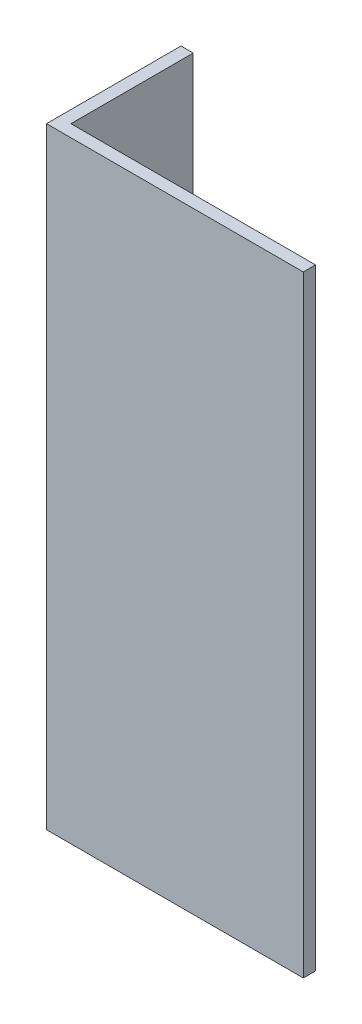
ISO-10303-21;
HEADER;
FILE_DESCRIPTION(('STEP AP214'),'2;1');
FILE_NAME('part.step','',(''),(''),'','','');
FILE_SCHEMA(('AUTOMOTIVE_DESIGN { 1 0 10303 214 1 1 1 1 }'));
ENDSEC;
DATA;
#1=APPLICATION_CONTEXT('core data for automotive mechanical design processes');
#2=APPLICATION_PROTOCOL_DEFINITION('international standard','automotive_design',2000,#1);
#3=PRODUCT_CONTEXT('',#1,'mechanical');
#4=PRODUCT('Part','Part','',(#3));
#5=PRODUCT_RELATED_PRODUCT_CATEGORY('part','',(#4));
#6=PRODUCT_DEFINITION_FORMATION('','',#4);
#7=PRODUCT_DEFINITION_CONTEXT('part definition',#1,'design');
#8=PRODUCT_DEFINITION('design','',#6,#7);
#9=PRODUCT_DEFINITION_SHAPE('','',#8);
#10=(LENGTH_UNIT() NAMED_UNIT(*) SI_UNIT(.MILLI.,.METRE.));
#11=(NAMED_UNIT(*) PLANE_ANGLE_UNIT() SI_UNIT($,.RADIAN.));
#12=(NAMED_UNIT(*) SI_UNIT($,.STERADIAN.) SOLID_ANGLE_UNIT());
#13=UNCERTAINTY_MEASURE_WITH_UNIT(LENGTH_MEASURE(1.E-05),#10,'distance_accuracy_value','');
#14=(GEOMETRIC_REPRESENTATION_CONTEXT(3) GLOBAL_UNCERTAINTY_ASSIGNED_CONTEXT((#13)) GLOBAL_UNIT_ASSIGNED_CONTEXT((#10,
#11,#12)) REPRESENTATION_CONTEXT('',''));
#15=CARTESIAN_POINT('',(0.,0.,0.));
#16=DIRECTION('',(0.,0.,1.));
#17=DIRECTION('',(1.,0.,0.));
#18=AXIS2_PLACEMENT_3D('',#15,#16,#17);
#19=CARTESIAN_POINT('',(-10.,50.,-9.5));
#20=DIRECTION('',(0.,0.,1.));
#21=DIRECTION('',(1.,0.,0.));
#22=AXIS2_PLACEMENT_3D('',#19,#20,#21);
#23=PLANE('',#22);
#24=DIRECTION('',(-1.,0.,0.));
#25=VECTOR('',#24,1.);
#26=CARTESIAN_POINT('',(-10.,0.,-9.5));
#27=LINE('',#26,#25);
#28=CARTESIAN_POINT('',(-10.,0.,-9.5));
#29=VERTEX_POINT('',#28);
#30=CARTESIAN_POINT('',(-11.,0.,-9.5));
#31=VERTEX_POINT('',#30);
#32=EDGE_CURVE('E117',#29,#31,#27,.T.);
#33=ORIENTED_EDGE('',*,*,#32,.T.);
#34=DIRECTION('',(0.,-1.,0.));
#35=VECTOR('',#34,1.);
#36=CARTESIAN_POINT('',(-11.,50.,-9.5));
#37=LINE('',#36,#35);
#38=CARTESIAN_POINT('',(-11.,50.,-9.5));
#39=VERTEX_POINT('',#38);
#40=EDGE_CURVE('E11',#39,#31,#37,.T.);
#41=ORIENTED_EDGE('',*,*,#40,.F.);
#42=DIRECTION('',(-1.,0.,0.));
#43=VECTOR('',#42,1.);
#44=CARTESIAN_POINT('',(-10.,50.,-9.5));
#45=LINE('',#44,#43);
#46=CARTESIAN_POINT('',(-10.,50.,-9.5));
#47=VERTEX_POINT('',#46);
#48=EDGE_CURVE('E127',#47,#39,#45,.T.);
#49=ORIENTED_EDGE('',*,*,#48,.F.);
#50=DIRECTION('',(0.,-1.,0.));
#51=VECTOR('',#50,1.);
#52=CARTESIAN_POINT('',(-10.,50.,-9.5));
#53=LINE('',#52,#51);
#54=EDGE_CURVE('E113',#47,#29,#53,.T.);
#55=ORIENTED_EDGE('',*,*,#54,.T.);
#56=EDGE_LOOP('',(#33,#41,#49,#55));
#57=FACE_BOUND('',#56,.T.);
#58=ADVANCED_FACE('F33',(#57),#23,.F.);
#59=CARTESIAN_POINT('',(-11.,50.,-9.5));
#60=DIRECTION('',(1.,0.,0.));
#61=DIRECTION('',(0.,0.,-1.));
#62=AXIS2_PLACEMENT_3D('',#59,#60,#61);
#63=PLANE('',#62);
#64=DIRECTION('',(0.,0.,1.));
#65=VECTOR('',#64,1.);
#66=CARTESIAN_POINT('',(-11.,0.,-9.5));
#67=LINE('',#66,#65);
#68=CARTESIAN_POINT('',(-11.,0.,1.5));
#69=VERTEX_POINT('',#68);
#70=EDGE_CURVE('E120',#31,#69,#67,.T.);
#71=ORIENTED_EDGE('',*,*,#70,.T.);
#72=DIRECTION('',(0.,-1.,0.));
#73=VECTOR('',#72,1.);
#74=CARTESIAN_POINT('',(-11.,50.,1.5));
#75=LINE('',#74,#73);
#76=CARTESIAN_POINT('',(-11.,50.,1.5));
#77=VERTEX_POINT('',#76);
#78=EDGE_CURVE('E41',#77,#69,#75,.T.);
#79=ORIENTED_EDGE('',*,*,#78,.F.);
#80=DIRECTION('',(0.,0.,1.));
#81=VECTOR('',#80,1.);
#82=CARTESIAN_POINT('',(-11.,50.,-9.5));
#83=LINE('',#82,#81);
#84=EDGE_CURVE('E86',#39,#77,#83,.T.);
#85=ORIENTED_EDGE('',*,*,#84,.F.);
#86=ORIENTED_EDGE('',*,*,#40,.T.);
#87=EDGE_LOOP('',(#71,#79,#85,#86));
#88=FACE_BOUND('',#87,.T.);
#89=ADVANCED_FACE('F151',(#88),#63,.F.);
#90=CARTESIAN_POINT('',(-11.,50.,1.5));
#91=DIRECTION('',(0.,0.,-1.));
#92=DIRECTION('',(-1.,0.,0.));
#93=AXIS2_PLACEMENT_3D('',#90,#91,#92);
#94=PLANE('',#93);
#95=DIRECTION('',(1.,0.,0.));
#96=VECTOR('',#95,1.);
#97=CARTESIAN_POINT('',(-11.,0.,1.5));
#98=LINE('',#97,#96);
#99=CARTESIAN_POINT('',(10.,0.,1.5));
#100=VERTEX_POINT('',#99);
#101=EDGE_CURVE('E122',#69,#100,#98,.T.);
#102=ORIENTED_EDGE('',*,*,#101,.T.);
#103=DIRECTION('',(0.,-1.,0.));
#104=VECTOR('',#103,1.);
#105=CARTESIAN_POINT('',(10.,50.,1.5));
#106=LINE('',#105,#104);
#107=CARTESIAN_POINT('',(10.,50.,1.5));
#108=VERTEX_POINT('',#107);
#109=EDGE_CURVE('E108',#108,#100,#106,.T.);
#110=ORIENTED_EDGE('',*,*,#109,.F.);
#111=DIRECTION('',(1.,0.,0.));
#112=VECTOR('',#111,1.);
#113=CARTESIAN_POINT('',(-11.,50.,1.5));
#114=LINE('',#113,#112);
#115=EDGE_CURVE('E99',#77,#108,#114,.T.);
#116=ORIENTED_EDGE('',*,*,#115,.F.);
#117=ORIENTED_EDGE('',*,*,#78,.T.);
#118=EDGE_LOOP('',(#102,#110,#116,#117));
#119=FACE_BOUND('',#118,.T.);
#120=ADVANCED_FACE('F133',(#119),#94,.F.);
#121=CARTESIAN_POINT('',(10.,50.,1.5));
#122=DIRECTION('',(-1.,0.,0.));
#123=DIRECTION('',(0.,0.,1.));
#124=AXIS2_PLACEMENT_3D('',#121,#122,#123);
#125=PLANE('',#124);
#126=DIRECTION('',(0.,0.,-1.));
#127=VECTOR('',#126,1.);
#128=CARTESIAN_POINT('',(10.,0.,1.5));
#129=LINE('',#128,#127);
#130=CARTESIAN_POINT('',(10.,0.,0.499999999999999));
#131=VERTEX_POINT('',#130);
#132=EDGE_CURVE('E107',#100,#131,#129,.T.);
#133=ORIENTED_EDGE('',*,*,#132,.T.);
#134=DIRECTION('',(0.,-1.,0.));
#135=VECTOR('',#134,1.);
#136=CARTESIAN_POINT('',(10.,50.,0.499999999999999));
#137=LINE('',#136,#135);
#138=CARTESIAN_POINT('',(10.,50.,0.499999999999999));
#139=VERTEX_POINT('',#138);
#140=EDGE_CURVE('E104',#139,#131,#137,.T.);
#141=ORIENTED_EDGE('',*,*,#140,.F.);
#142=DIRECTION('',(0.,0.,-1.));
#143=VECTOR('',#142,1.);
#144=CARTESIAN_POINT('',(10.,50.,1.5));
#145=LINE('',#144,#143);
#146=EDGE_CURVE('E93',#108,#139,#145,.T.);
#147=ORIENTED_EDGE('',*,*,#146,.F.);
#148=ORIENTED_EDGE('',*,*,#109,.T.);
#149=EDGE_LOOP('',(#133,#141,#147,#148));
#150=FACE_BOUND('',#149,.T.);
#151=ADVANCED_FACE('F105',(#150),#125,.F.);
#152=CARTESIAN_POINT('',(10.,50.,0.499999999999999));
#153=DIRECTION('',(0.,0.,1.));
#154=DIRECTION('',(1.,0.,0.));
#155=AXIS2_PLACEMENT_3D('',#152,#153,#154);
#156=PLANE('',#155);
#157=DIRECTION('',(-1.,0.,0.));
#158=VECTOR('',#157,1.);
#159=CARTESIAN_POINT('',(10.,0.,0.499999999999999));
#160=LINE('',#159,#158);
#161=CARTESIAN_POINT('',(-10.,0.,0.500000000000001));
#162=VERTEX_POINT('',#161);
#163=EDGE_CURVE('E72',#131,#162,#160,.T.);
#164=ORIENTED_EDGE('',*,*,#163,.T.);
#165=DIRECTION('',(0.,-1.,0.));
#166=VECTOR('',#165,1.);
#167=CARTESIAN_POINT('',(-10.,50.,0.500000000000001));
#168=LINE('',#167,#166);
#169=CARTESIAN_POINT('',(-10.,50.,0.500000000000001));
#170=VERTEX_POINT('',#169);
#171=EDGE_CURVE('E109',#170,#162,#168,.T.);
#172=ORIENTED_EDGE('',*,*,#171,.F.);
#173=DIRECTION('',(-1.,0.,0.));
#174=VECTOR('',#173,1.);
#175=CARTESIAN_POINT('',(10.,50.,0.499999999999999));
#176=LINE('',#175,#174);
#177=EDGE_CURVE('E97',#139,#170,#176,.T.);
#178=ORIENTED_EDGE('',*,*,#177,.F.);
#179=ORIENTED_EDGE('',*,*,#140,.T.);
#180=EDGE_LOOP('',(#164,#172,#178,#179));
#181=FACE_BOUND('',#180,.T.);
#182=ADVANCED_FACE('F111',(#181),#156,.F.);
#183=CARTESIAN_POINT('',(-10.,50.,0.500000000000001));
#184=DIRECTION('',(-1.,0.,0.));
#185=DIRECTION('',(0.,0.,1.));
#186=AXIS2_PLACEMENT_3D('',#183,#184,#185);
#187=PLANE('',#186);
#188=DIRECTION('',(0.,0.,-1.));
#189=VECTOR('',#188,1.);
#190=CARTESIAN_POINT('',(-10.,0.,0.500000000000001));
#191=LINE('',#190,#189);
#192=EDGE_CURVE('E78',#162,#29,#191,.T.);
#193=ORIENTED_EDGE('',*,*,#192,.T.);
#194=ORIENTED_EDGE('',*,*,#54,.F.);
#195=DIRECTION('',(0.,0.,-1.));
#196=VECTOR('',#195,1.);
#197=CARTESIAN_POINT('',(-10.,50.,0.500000000000001));
#198=LINE('',#197,#196);
#199=EDGE_CURVE('E49',#170,#47,#198,.T.);
#200=ORIENTED_EDGE('',*,*,#199,.F.);
#201=ORIENTED_EDGE('',*,*,#171,.T.);
#202=EDGE_LOOP('',(#193,#194,#200,#201));
#203=FACE_BOUND('',#202,.T.);
#204=ADVANCED_FACE('F140',(#203),#187,.F.);
#205=CARTESIAN_POINT('',(0.,50.,0.));
#206=DIRECTION('',(0.,1.,0.));
#207=DIRECTION('',(0.,0.,1.));
#208=AXIS2_PLACEMENT_3D('',#205,#206,#207);
#209=PLANE('',#208);
#210=ORIENTED_EDGE('',*,*,#48,.T.);
#211=ORIENTED_EDGE('',*,*,#84,.T.);
#212=ORIENTED_EDGE('',*,*,#115,.T.);
#213=ORIENTED_EDGE('',*,*,#146,.T.);
#214=ORIENTED_EDGE('',*,*,#177,.T.);
#215=ORIENTED_EDGE('',*,*,#199,.T.);
#216=EDGE_LOOP('',(#210,#211,#212,#213,#214,#215));
#217=FACE_BOUND('',#216,.T.);
#218=ADVANCED_FACE('F95',(#217),#209,.T.);
#219=CARTESIAN_POINT('',(0.,0.,0.));
#220=DIRECTION('',(0.,1.,0.));
#221=DIRECTION('',(0.,0.,1.));
#222=AXIS2_PLACEMENT_3D('',#219,#220,#221);
#223=PLANE('',#222);
#224=ORIENTED_EDGE('',*,*,#32,.F.);
#225=ORIENTED_EDGE('',*,*,#192,.F.);
#226=ORIENTED_EDGE('',*,*,#163,.F.);
#227=ORIENTED_EDGE('',*,*,#132,.F.);
#228=ORIENTED_EDGE('',*,*,#101,.F.);
#229=ORIENTED_EDGE('',*,*,#70,.F.);
#230=EDGE_LOOP('',(#224,#225,#226,#227,#228,#229));
#231=FACE_BOUND('',#230,.T.);
#232=ADVANCED_FACE('F136',(#231),#223,.F.);
#233=CLOSED_SHELL('',(#58,#89,#120,#151,#182,#204,#218,#232));
#234=MANIFOLD_SOLID_BREP('B2',#233);
#235=ADVANCED_BREP_SHAPE_REPRESENTATION('',(#18,#234),#14);
#236=SHAPE_DEFINITION_REPRESENTATION(#9,#235);
ENDSEC;
END-ISO-10303-21;
